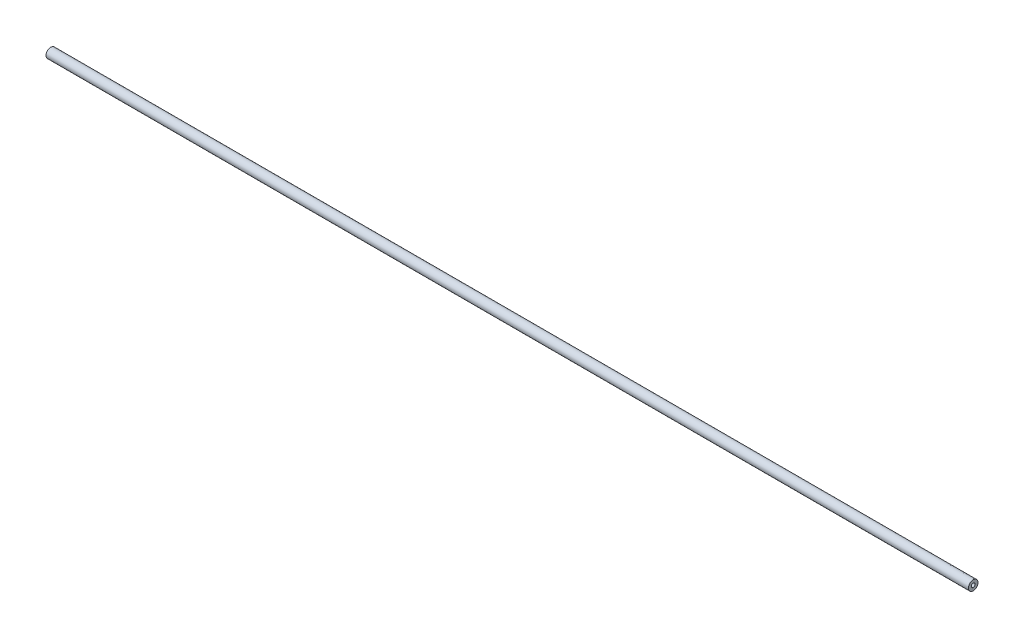
ISO-10303-21;
HEADER;
FILE_DESCRIPTION(('STEP AP214'),'2;1');
FILE_NAME('part.step','',(''),(''),'','','');
FILE_SCHEMA(('AUTOMOTIVE_DESIGN { 1 0 10303 214 1 1 1 1 }'));
ENDSEC;
DATA;
#1=APPLICATION_CONTEXT('core data for automotive mechanical design processes');
#2=APPLICATION_PROTOCOL_DEFINITION('international standard','automotive_design',2000,#1);
#3=PRODUCT_CONTEXT('',#1,'mechanical');
#4=PRODUCT('Part','Part','',(#3));
#5=PRODUCT_RELATED_PRODUCT_CATEGORY('part','',(#4));
#6=PRODUCT_DEFINITION_FORMATION('','',#4);
#7=PRODUCT_DEFINITION_CONTEXT('part definition',#1,'design');
#8=PRODUCT_DEFINITION('design','',#6,#7);
#9=PRODUCT_DEFINITION_SHAPE('','',#8);
#10=(LENGTH_UNIT() NAMED_UNIT(*) SI_UNIT(.MILLI.,.METRE.));
#11=(NAMED_UNIT(*) PLANE_ANGLE_UNIT() SI_UNIT($,.RADIAN.));
#12=(NAMED_UNIT(*) SI_UNIT($,.STERADIAN.) SOLID_ANGLE_UNIT());
#13=UNCERTAINTY_MEASURE_WITH_UNIT(LENGTH_MEASURE(1.E-05),#10,'distance_accuracy_value','');
#14=(GEOMETRIC_REPRESENTATION_CONTEXT(3) GLOBAL_UNCERTAINTY_ASSIGNED_CONTEXT((#13)) GLOBAL_UNIT_ASSIGNED_CONTEXT((#10,
#11,#12)) REPRESENTATION_CONTEXT('',''));
#15=CARTESIAN_POINT('',(0.,0.,0.));
#16=DIRECTION('',(0.,0.,1.));
#17=DIRECTION('',(1.,0.,0.));
#18=AXIS2_PLACEMENT_3D('',#15,#16,#17);
#19=CARTESIAN_POINT('',(3.,1.6,0.));
#20=DIRECTION('',(1.,0.,0.));
#21=DIRECTION('',(0.,0.,-1.));
#22=AXIS2_PLACEMENT_3D('',#19,#20,#21);
#23=PLANE('',#22);
#24=CARTESIAN_POINT('',(3.,0.,0.));
#25=DIRECTION('',(1.,0.,0.));
#26=DIRECTION('',(0.,0.,-1.));
#27=AXIS2_PLACEMENT_3D('',#24,#25,#26);
#28=CIRCLE('',#27,4.);
#29=CARTESIAN_POINT('',(3.,0.,-4.));
#30=VERTEX_POINT('',#29);
#31=EDGE_CURVE('E10',#30,#30,#28,.T.);
#32=ORIENTED_EDGE('',*,*,#31,.T.);
#33=EDGE_LOOP('',(#32));
#34=FACE_BOUND('',#33,.T.);
#35=CARTESIAN_POINT('',(3.,0.,0.));
#36=DIRECTION('',(1.,0.,0.));
#37=DIRECTION('',(0.,0.,-1.));
#38=AXIS2_PLACEMENT_3D('',#35,#36,#37);
#39=CIRCLE('',#38,1.6);
#40=CARTESIAN_POINT('',(3.,0.,-1.6));
#41=VERTEX_POINT('',#40);
#42=EDGE_CURVE('E53',#41,#41,#39,.T.);
#43=ORIENTED_EDGE('',*,*,#42,.F.);
#44=EDGE_LOOP('',(#43));
#45=FACE_BOUND('',#44,.T.);
#46=ADVANCED_FACE('F31',(#34,#45),#23,.T.);
#47=CARTESIAN_POINT('',(0.,0.,0.));
#48=DIRECTION('',(1.,0.,0.));
#49=DIRECTION('',(0.,0.,-1.));
#50=AXIS2_PLACEMENT_3D('',#47,#48,#49);
#51=CYLINDRICAL_SURFACE('',#50,3.99999999999995);
#52=CARTESIAN_POINT('',(-767.,0.,0.));
#53=DIRECTION('',(1.,0.,0.));
#54=DIRECTION('',(0.,0.,-1.));
#55=AXIS2_PLACEMENT_3D('',#52,#53,#54);
#56=CIRCLE('',#55,3.9999999999999);
#57=CARTESIAN_POINT('',(-767.,0.,-3.9999999999999));
#58=VERTEX_POINT('',#57);
#59=EDGE_CURVE('E37',#58,#58,#56,.T.);
#60=ORIENTED_EDGE('',*,*,#59,.T.);
#61=EDGE_LOOP('',(#60));
#62=FACE_BOUND('',#61,.T.);
#63=ORIENTED_EDGE('',*,*,#31,.F.);
#64=EDGE_LOOP('',(#63));
#65=FACE_BOUND('',#64,.T.);
#66=ADVANCED_FACE('F61',(#62,#65),#51,.T.);
#67=CARTESIAN_POINT('',(-767.,1.6,0.));
#68=DIRECTION('',(-1.,0.,0.));
#69=DIRECTION('',(0.,0.,1.));
#70=AXIS2_PLACEMENT_3D('',#67,#68,#69);
#71=PLANE('',#70);
#72=CARTESIAN_POINT('',(-767.,0.,0.));
#73=DIRECTION('',(1.,0.,0.));
#74=DIRECTION('',(0.,0.,-1.));
#75=AXIS2_PLACEMENT_3D('',#72,#73,#74);
#76=CIRCLE('',#75,1.6);
#77=CARTESIAN_POINT('',(-767.,0.,-1.6));
#78=VERTEX_POINT('',#77);
#79=EDGE_CURVE('E41',#78,#78,#76,.T.);
#80=ORIENTED_EDGE('',*,*,#79,.T.);
#81=EDGE_LOOP('',(#80));
#82=FACE_BOUND('',#81,.T.);
#83=ORIENTED_EDGE('',*,*,#59,.F.);
#84=EDGE_LOOP('',(#83));
#85=FACE_BOUND('',#84,.T.);
#86=ADVANCED_FACE('F65',(#82,#85),#71,.T.);
#87=CARTESIAN_POINT('',(0.,0.,0.));
#88=DIRECTION('',(1.,0.,0.));
#89=DIRECTION('',(0.,0.,-1.));
#90=AXIS2_PLACEMENT_3D('',#87,#88,#89);
#91=CYLINDRICAL_SURFACE('',#90,1.6);
#92=CARTESIAN_POINT('',(-764.,0.,0.));
#93=DIRECTION('',(1.,0.,0.));
#94=DIRECTION('',(0.,0.,-1.));
#95=AXIS2_PLACEMENT_3D('',#92,#93,#94);
#96=CIRCLE('',#95,1.6);
#97=CARTESIAN_POINT('',(-764.,0.,-1.6));
#98=VERTEX_POINT('',#97);
#99=EDGE_CURVE('E45',#98,#98,#96,.T.);
#100=ORIENTED_EDGE('',*,*,#99,.T.);
#101=EDGE_LOOP('',(#100));
#102=FACE_BOUND('',#101,.T.);
#103=ORIENTED_EDGE('',*,*,#79,.F.);
#104=EDGE_LOOP('',(#103));
#105=FACE_BOUND('',#104,.T.);
#106=ADVANCED_FACE('F69',(#102,#105),#91,.F.);
#107=CARTESIAN_POINT('',(-764.,1.6,0.));
#108=DIRECTION('',(-1.,0.,0.));
#109=DIRECTION('',(0.,0.,1.));
#110=AXIS2_PLACEMENT_3D('',#107,#108,#109);
#111=PLANE('',#110);
#112=ORIENTED_EDGE('',*,*,#99,.F.);
#113=EDGE_LOOP('',(#112));
#114=FACE_BOUND('',#113,.T.);
#115=ADVANCED_FACE('F76',(#114),#111,.T.);
#116=CARTESIAN_POINT('',(0.,1.6,0.));
#117=DIRECTION('',(1.,0.,0.));
#118=DIRECTION('',(0.,0.,-1.));
#119=AXIS2_PLACEMENT_3D('',#116,#117,#118);
#120=PLANE('',#119);
#121=CARTESIAN_POINT('',(0.,0.,0.));
#122=DIRECTION('',(1.,0.,0.));
#123=DIRECTION('',(0.,0.,-1.));
#124=AXIS2_PLACEMENT_3D('',#121,#122,#123);
#125=CIRCLE('',#124,1.6);
#126=CARTESIAN_POINT('',(0.,0.,-1.6));
#127=VERTEX_POINT('',#126);
#128=EDGE_CURVE('E50',#127,#127,#125,.T.);
#129=ORIENTED_EDGE('',*,*,#128,.T.);
#130=EDGE_LOOP('',(#129));
#131=FACE_BOUND('',#130,.T.);
#132=ADVANCED_FACE('F80',(#131),#120,.T.);
#133=CARTESIAN_POINT('',(0.,0.,0.));
#134=DIRECTION('',(1.,0.,0.));
#135=DIRECTION('',(0.,0.,-1.));
#136=AXIS2_PLACEMENT_3D('',#133,#134,#135);
#137=CYLINDRICAL_SURFACE('',#136,1.6);
#138=ORIENTED_EDGE('',*,*,#42,.T.);
#139=EDGE_LOOP('',(#138));
#140=FACE_BOUND('',#139,.T.);
#141=ORIENTED_EDGE('',*,*,#128,.F.);
#142=EDGE_LOOP('',(#141));
#143=FACE_BOUND('',#142,.T.);
#144=ADVANCED_FACE('F57',(#140,#143),#137,.F.);
#145=CLOSED_SHELL('',(#46,#66,#86,#106,#115,#132,#144));
#146=MANIFOLD_SOLID_BREP('B2',#145);
#147=ADVANCED_BREP_SHAPE_REPRESENTATION('',(#18,#146),#14);
#148=SHAPE_DEFINITION_REPRESENTATION(#9,#147);
ENDSEC;
END-ISO-10303-21;
